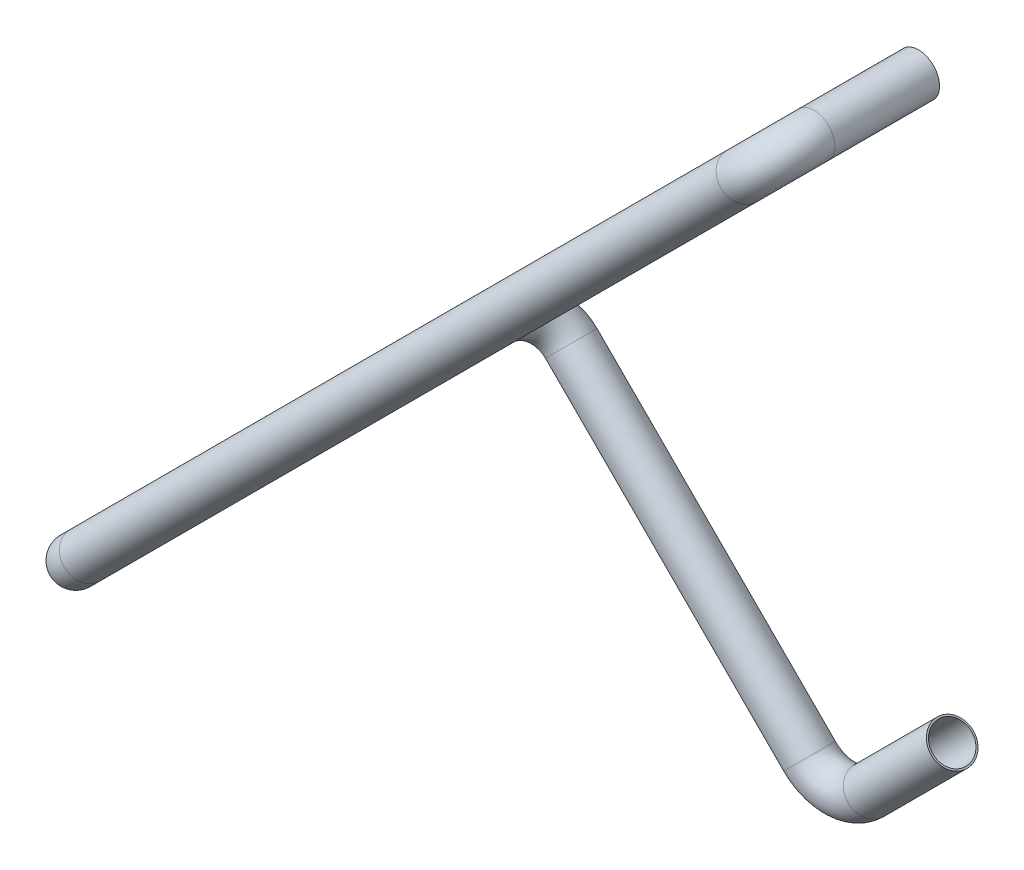
ISO-10303-21;
HEADER;
FILE_DESCRIPTION(('STEP AP214'),'2;1');
FILE_NAME('part.step','',(''),(''),'','','');
FILE_SCHEMA(('AUTOMOTIVE_DESIGN { 1 0 10303 214 1 1 1 1 }'));
ENDSEC;
DATA;
#1=APPLICATION_CONTEXT('core data for automotive mechanical design processes');
#2=APPLICATION_PROTOCOL_DEFINITION('international standard','automotive_design',2000,#1);
#3=PRODUCT_CONTEXT('',#1,'mechanical');
#4=PRODUCT('Part','Part','',(#3));
#5=PRODUCT_RELATED_PRODUCT_CATEGORY('part','',(#4));
#6=PRODUCT_DEFINITION_FORMATION('','',#4);
#7=PRODUCT_DEFINITION_CONTEXT('part definition',#1,'design');
#8=PRODUCT_DEFINITION('design','',#6,#7);
#9=PRODUCT_DEFINITION_SHAPE('','',#8);
#10=(LENGTH_UNIT() NAMED_UNIT(*) SI_UNIT(.MILLI.,.METRE.));
#11=(NAMED_UNIT(*) PLANE_ANGLE_UNIT() SI_UNIT($,.RADIAN.));
#12=(NAMED_UNIT(*) SI_UNIT($,.STERADIAN.) SOLID_ANGLE_UNIT());
#13=UNCERTAINTY_MEASURE_WITH_UNIT(LENGTH_MEASURE(1.E-05),#10,'distance_accuracy_value','');
#14=(GEOMETRIC_REPRESENTATION_CONTEXT(3) GLOBAL_UNCERTAINTY_ASSIGNED_CONTEXT((#13)) GLOBAL_UNIT_ASSIGNED_CONTEXT((#10,
#11,#12)) REPRESENTATION_CONTEXT('',''));
#15=CARTESIAN_POINT('',(0.,0.,0.));
#16=DIRECTION('',(0.,0.,1.));
#17=DIRECTION('',(1.,0.,0.));
#18=AXIS2_PLACEMENT_3D('',#15,#16,#17);
#19=CARTESIAN_POINT('',(-117.102539818742,-296.707662240125,-102.229900000001));
#20=DIRECTION('',(0.707106781186547,0.707106781186548,0.));
#21=DIRECTION('',(-0.707106781186548,0.707106781186547,0.));
#22=AXIS2_PLACEMENT_3D('',#19,#20,#21);
#23=CYLINDRICAL_SURFACE('',#22,6.35);
#24=CARTESIAN_POINT('',(-117.102539818742,-296.707662240125,-102.229900000001));
#25=DIRECTION('',(0.707106781186548,0.707106781186547,0.));
#26=DIRECTION('',(0.499999999999995,-0.500000000000006,0.707106781186548));
#27=AXIS2_PLACEMENT_3D('',#24,#25,#26);
#28=CIRCLE('',#27,6.35);
#29=CARTESIAN_POINT('',(-112.612411758207,-301.197790300659,-102.229900000001));
#30=VERTEX_POINT('',#29);
#31=EDGE_CURVE('E52',#30,#30,#28,.T.);
#32=ORIENTED_EDGE('',*,*,#31,.T.);
#33=EDGE_LOOP('',(#32));
#34=FACE_BOUND('',#33,.T.);
#35=CARTESIAN_POINT('',(-92.0709597647378,-271.676082186121,-102.229900000001));
#36=DIRECTION('',(0.707106781186548,0.707106781186547,0.));
#37=DIRECTION('',(0.499999999999995,-0.500000000000006,0.707106781186548));
#38=AXIS2_PLACEMENT_3D('',#35,#36,#37);
#39=CIRCLE('',#38,6.35);
#40=CARTESIAN_POINT('',(-88.8959597647378,-274.851082186121,-97.7397719394663));
#41=VERTEX_POINT('',#40);
#42=EDGE_CURVE('E12',#41,#41,#39,.T.);
#43=ORIENTED_EDGE('',*,*,#42,.F.);
#44=EDGE_LOOP('',(#43));
#45=FACE_BOUND('',#44,.T.);
#46=ADVANCED_FACE('F46',(#34,#45),#23,.T.);
#47=CARTESIAN_POINT('',(-126.082795939811,-287.727406119056,-102.229900000001));
#48=DIRECTION('',(0.,0.,1.));
#49=DIRECTION('',(0.,-1.,0.));
#50=AXIS2_PLACEMENT_3D('',#47,#48,#49);
#51=TOROIDAL_SURFACE('',#50,12.7,6.35);
#52=CARTESIAN_POINT('',(-135.06305206088,-296.707662240125,-102.229900000001));
#53=DIRECTION('',(0.707106781186548,-0.707106781186547,0.));
#54=DIRECTION('',(-0.500000000000004,-0.5,0.707106781186546));
#55=AXIS2_PLACEMENT_3D('',#52,#53,#54);
#56=CIRCLE('',#55,6.35);
#57=CARTESIAN_POINT('',(-139.553180121414,-301.197790300659,-102.229900000001));
#58=VERTEX_POINT('',#57);
#59=EDGE_CURVE('E56',#58,#58,#56,.T.);
#60=CARTESIAN_POINT('',(-126.082795939811,-287.727406119056,-102.229900000001));
#61=DIRECTION('',(0.,0.,1.));
#62=DIRECTION('',(0.,-1.,0.));
#63=AXIS2_PLACEMENT_3D('',#60,#61,#62);
#64=CIRCLE('',#63,19.05);
#65=EDGE_CURVE('',#58,#30,#64,.T.);
#66=ORIENTED_EDGE('',*,*,#59,.T.);
#67=ORIENTED_EDGE('',*,*,#31,.F.);
#68=ORIENTED_EDGE('',*,*,#65,.T.);
#69=ORIENTED_EDGE('',*,*,#65,.F.);
#70=EDGE_LOOP('',(#66,#68,#67,#69));
#71=FACE_BOUND('',#70,.T.);
#72=ADVANCED_FACE('F138',(#71),#51,.T.);
#73=CARTESIAN_POINT('',(-206.905101029433,-224.865613271571,-102.229900000001));
#74=DIRECTION('',(0.707106781186547,-0.707106781186548,0.));
#75=DIRECTION('',(0.707106781186548,0.707106781186547,0.));
#76=AXIS2_PLACEMENT_3D('',#73,#74,#75);
#77=CYLINDRICAL_SURFACE('',#76,6.35);
#78=CARTESIAN_POINT('',(-206.905101029433,-224.865613271571,-102.229900000001));
#79=DIRECTION('',(0.707106781186548,-0.707106781186547,0.));
#80=DIRECTION('',(-0.500000000000004,-0.5,0.707106781186546));
#81=AXIS2_PLACEMENT_3D('',#78,#79,#80);
#82=CIRCLE('',#81,6.35);
#83=CARTESIAN_POINT('',(-206.905101029433,-224.865613271571,-108.579900000001));
#84=VERTEX_POINT('',#83);
#85=EDGE_CURVE('E60',#84,#84,#82,.T.);
#86=ORIENTED_EDGE('',*,*,#85,.T.);
#87=EDGE_LOOP('',(#86));
#88=FACE_BOUND('',#87,.T.);
#89=ORIENTED_EDGE('',*,*,#59,.F.);
#90=EDGE_LOOP('',(#89));
#91=FACE_BOUND('',#90,.T.);
#92=ADVANCED_FACE('F142',(#88,#91),#77,.T.);
#93=CARTESIAN_POINT('',(-206.905101029433,-224.865613271571,-89.5299000000011));
#94=DIRECTION('',(-0.707106781186548,-0.707106781186548,0.));
#95=DIRECTION('',(0.707106781186548,-0.707106781186548,0.));
#96=AXIS2_PLACEMENT_3D('',#93,#94,#95);
#97=TOROIDAL_SURFACE('',#96,12.7,6.35);
#98=CARTESIAN_POINT('',(-215.885357150502,-215.885357150502,-89.529900000001));
#99=DIRECTION('',(0.,0.,-1.));
#100=DIRECTION('',(0.,-1.,0.));
#101=AXIS2_PLACEMENT_3D('',#98,#99,#100);
#102=CIRCLE('',#101,6.35);
#103=CARTESIAN_POINT('',(-220.375485211037,-211.395229089968,-89.5299000000009));
#104=VERTEX_POINT('',#103);
#105=EDGE_CURVE('E65',#104,#104,#102,.T.);
#106=CARTESIAN_POINT('',(-206.905101029433,-224.865613271571,-89.5299000000011));
#107=DIRECTION('',(-0.707106781186548,-0.707106781186548,0.));
#108=DIRECTION('',(0.707106781186548,-0.707106781186548,0.));
#109=AXIS2_PLACEMENT_3D('',#106,#107,#108);
#110=CIRCLE('',#109,19.05);
#111=EDGE_CURVE('',#104,#84,#110,.T.);
#112=ORIENTED_EDGE('',*,*,#105,.T.);
#113=ORIENTED_EDGE('',*,*,#85,.F.);
#114=ORIENTED_EDGE('',*,*,#111,.T.);
#115=ORIENTED_EDGE('',*,*,#111,.F.);
#116=EDGE_LOOP('',(#112,#114,#113,#115));
#117=FACE_BOUND('',#116,.T.);
#118=ADVANCED_FACE('F148',(#117),#97,.T.);
#119=CARTESIAN_POINT('',(-215.885357150503,-215.885357150503,31.5419456141631));
#120=DIRECTION('',(0.,0.,-1.));
#121=DIRECTION('',(-1.,0.,0.));
#122=AXIS2_PLACEMENT_3D('',#119,#120,#121);
#123=CYLINDRICAL_SURFACE('',#122,6.35);
#124=CARTESIAN_POINT('',(-215.885357150503,-215.885357150503,31.5419456141631));
#125=DIRECTION('',(0.,0.,-1.));
#126=DIRECTION('',(0.,-1.,0.));
#127=AXIS2_PLACEMENT_3D('',#124,#125,#126);
#128=CIRCLE('',#127,6.35);
#129=CARTESIAN_POINT('',(-220.375485211037,-220.375485211037,31.5419456141631));
#130=VERTEX_POINT('',#129);
#131=EDGE_CURVE('E68',#130,#130,#128,.T.);
#132=ORIENTED_EDGE('',*,*,#131,.T.);
#133=EDGE_LOOP('',(#132));
#134=FACE_BOUND('',#133,.T.);
#135=ORIENTED_EDGE('',*,*,#105,.F.);
#136=EDGE_LOOP('',(#135));
#137=FACE_BOUND('',#136,.T.);
#138=ADVANCED_FACE('F155',(#134,#137),#123,.T.);
#139=CARTESIAN_POINT('',(-206.905101029433,-206.905101029433,31.5419456141631));
#140=DIRECTION('',(0.707106781186548,-0.707106781186548,0.));
#141=DIRECTION('',(0.707106781186548,0.707106781186548,0.));
#142=AXIS2_PLACEMENT_3D('',#139,#140,#141);
#143=TOROIDAL_SURFACE('',#142,12.7,6.35);
#144=CARTESIAN_POINT('',(-206.905101029433,-206.905101029433,44.2419456141631));
#145=DIRECTION('',(-0.707106781186548,-0.707106781186548,0.));
#146=DIRECTION('',(0.499999999999999,-0.500000000000001,0.707106781186548));
#147=AXIS2_PLACEMENT_3D('',#144,#145,#146);
#148=CIRCLE('',#147,6.35);
#149=CARTESIAN_POINT('',(-206.905101029433,-206.905101029433,50.5919456141631));
#150=VERTEX_POINT('',#149);
#151=EDGE_CURVE('E71',#150,#150,#148,.T.);
#152=CARTESIAN_POINT('',(-206.905101029433,-206.905101029433,31.5419456141631));
#153=DIRECTION('',(0.707106781186548,-0.707106781186548,0.));
#154=DIRECTION('',(0.707106781186548,0.707106781186548,0.));
#155=AXIS2_PLACEMENT_3D('',#152,#153,#154);
#156=CIRCLE('',#155,19.05);
#157=EDGE_CURVE('',#150,#130,#156,.T.);
#158=ORIENTED_EDGE('',*,*,#151,.T.);
#159=ORIENTED_EDGE('',*,*,#131,.F.);
#160=ORIENTED_EDGE('',*,*,#157,.T.);
#161=ORIENTED_EDGE('',*,*,#157,.F.);
#162=EDGE_LOOP('',(#158,#160,#159,#161));
#163=FACE_BOUND('',#162,.T.);
#164=ADVANCED_FACE('F159',(#163),#143,.T.);
#165=CARTESIAN_POINT('',(-8.98025612106917,-8.98025612106917,44.2419456141641));
#166=DIRECTION('',(-0.707106781186547,-0.707106781186547,0.));
#167=DIRECTION('',(0.707106781186548,-0.707106781186548,0.));
#168=AXIS2_PLACEMENT_3D('',#165,#166,#167);
#169=CYLINDRICAL_SURFACE('',#168,6.35);
#170=CARTESIAN_POINT('',(-8.98025612106917,-8.98025612106917,44.2419456141641));
#171=DIRECTION('',(-0.707106781186548,-0.707106781186548,0.));
#172=DIRECTION('',(0.499999999999999,-0.500000000000001,0.707106781186548));
#173=AXIS2_PLACEMENT_3D('',#170,#171,#172);
#174=CIRCLE('',#173,6.35);
#175=CARTESIAN_POINT('',(-8.98025612106918,-8.98025612106918,50.5919456141641));
#176=VERTEX_POINT('',#175);
#177=EDGE_CURVE('E74',#176,#176,#174,.T.);
#178=ORIENTED_EDGE('',*,*,#177,.T.);
#179=EDGE_LOOP('',(#178));
#180=FACE_BOUND('',#179,.T.);
#181=ORIENTED_EDGE('',*,*,#151,.F.);
#182=EDGE_LOOP('',(#181));
#183=FACE_BOUND('',#182,.T.);
#184=ADVANCED_FACE('F163',(#180,#183),#169,.T.);
#185=CARTESIAN_POINT('',(-8.98025612106916,-8.98025612106916,31.5419456141641));
#186=DIRECTION('',(0.707106781186548,-0.707106781186548,0.));
#187=DIRECTION('',(0.707106781186548,0.707106781186548,0.));
#188=AXIS2_PLACEMENT_3D('',#185,#186,#187);
#189=TOROIDAL_SURFACE('',#188,12.7,6.35);
#190=CARTESIAN_POINT('',(0.,0.,31.5419456141641));
#191=DIRECTION('',(0.,0.,1.));
#192=DIRECTION('',(1.,0.,0.));
#193=AXIS2_PLACEMENT_3D('',#190,#191,#192);
#194=CIRCLE('',#193,6.35);
#195=CARTESIAN_POINT('',(4.49012806053458,4.49012806053458,31.5419456141641));
#196=VERTEX_POINT('',#195);
#197=EDGE_CURVE('E77',#196,#196,#194,.T.);
#198=CARTESIAN_POINT('',(-8.98025612106916,-8.98025612106916,31.5419456141641));
#199=DIRECTION('',(0.707106781186548,-0.707106781186548,0.));
#200=DIRECTION('',(0.707106781186548,0.707106781186548,0.));
#201=AXIS2_PLACEMENT_3D('',#198,#199,#200);
#202=CIRCLE('',#201,19.05);
#203=EDGE_CURVE('',#196,#176,#202,.T.);
#204=ORIENTED_EDGE('',*,*,#197,.T.);
#205=ORIENTED_EDGE('',*,*,#177,.F.);
#206=ORIENTED_EDGE('',*,*,#203,.T.);
#207=ORIENTED_EDGE('',*,*,#203,.F.);
#208=EDGE_LOOP('',(#204,#206,#205,#207));
#209=FACE_BOUND('',#208,.T.);
#210=ADVANCED_FACE('F133',(#209),#189,.T.);
#211=CARTESIAN_POINT('',(0.,0.,31.5419456141641));
#212=DIRECTION('',(0.,0.,-1.));
#213=DIRECTION('',(-1.,0.,0.));
#214=AXIS2_PLACEMENT_3D('',#211,#212,#213);
#215=CYLINDRICAL_SURFACE('',#214,6.35);
#216=ORIENTED_EDGE('',*,*,#197,.F.);
#217=EDGE_LOOP('',(#216));
#218=FACE_BOUND('',#217,.T.);
#219=CARTESIAN_POINT('',(0.,0.,0.));
#220=DIRECTION('',(0.,0.,1.));
#221=DIRECTION('',(1.,0.,0.));
#222=AXIS2_PLACEMENT_3D('',#219,#220,#221);
#223=CIRCLE('',#222,6.35);
#224=CARTESIAN_POINT('',(6.35,0.,0.));
#225=VERTEX_POINT('',#224);
#226=EDGE_CURVE('E78',#225,#225,#223,.T.);
#227=ORIENTED_EDGE('',*,*,#226,.T.);
#228=EDGE_LOOP('',(#227));
#229=FACE_BOUND('',#228,.T.);
#230=ADVANCED_FACE('F125',(#218,#229),#215,.T.);
#231=CARTESIAN_POINT('',(-92.0709597647378,-271.676082186121,-102.229900000001));
#232=DIRECTION('',(0.707106781186548,0.707106781186547,0.));
#233=DIRECTION('',(0.499999999999995,-0.500000000000006,0.707106781186548));
#234=AXIS2_PLACEMENT_3D('',#231,#232,#233);
#235=PLANE('',#234);
#236=CARTESIAN_POINT('',(-92.0709597647378,-271.676082186121,-102.229900000001));
#237=DIRECTION('',(0.707106781186548,0.707106781186547,0.));
#238=DIRECTION('',(-0.707106781186547,0.707106781186548,0.));
#239=AXIS2_PLACEMENT_3D('',#236,#237,#238);
#240=CIRCLE('',#239,5.842);
#241=CARTESIAN_POINT('',(-96.2018775804296,-267.545164370429,-102.229900000001));
#242=VERTEX_POINT('',#241);
#243=EDGE_CURVE('E81',#242,#242,#240,.T.);
#244=ORIENTED_EDGE('',*,*,#243,.F.);
#245=EDGE_LOOP('',(#244));
#246=FACE_BOUND('',#245,.T.);
#247=ORIENTED_EDGE('',*,*,#42,.T.);
#248=EDGE_LOOP('',(#247));
#249=FACE_BOUND('',#248,.T.);
#250=ADVANCED_FACE('F123',(#246,#249),#235,.T.);
#251=CARTESIAN_POINT('',(0.,0.,0.));
#252=DIRECTION('',(0.,0.,1.));
#253=DIRECTION('',(1.,0.,0.));
#254=AXIS2_PLACEMENT_3D('',#251,#252,#253);
#255=PLANE('',#254);
#256=CARTESIAN_POINT('',(0.,0.,0.));
#257=DIRECTION('',(0.,0.,1.));
#258=DIRECTION('',(1.,0.,0.));
#259=AXIS2_PLACEMENT_3D('',#256,#257,#258);
#260=CIRCLE('',#259,5.842);
#261=CARTESIAN_POINT('',(5.842,0.,0.));
#262=VERTEX_POINT('',#261);
#263=EDGE_CURVE('E84',#262,#262,#260,.T.);
#264=ORIENTED_EDGE('',*,*,#263,.T.);
#265=EDGE_LOOP('',(#264));
#266=FACE_BOUND('',#265,.T.);
#267=ORIENTED_EDGE('',*,*,#226,.F.);
#268=EDGE_LOOP('',(#267));
#269=FACE_BOUND('',#268,.T.);
#270=ADVANCED_FACE('F119',(#266,#269),#255,.F.);
#271=CARTESIAN_POINT('',(-117.102539818742,-296.707662240125,-102.229900000001));
#272=DIRECTION('',(0.707106781186547,0.707106781186548,0.));
#273=DIRECTION('',(-0.707106781186548,0.707106781186547,0.));
#274=AXIS2_PLACEMENT_3D('',#271,#272,#273);
#275=CYLINDRICAL_SURFACE('',#274,5.842);
#276=CARTESIAN_POINT('',(-117.102539818742,-296.707662240125,-102.229900000001));
#277=DIRECTION('',(0.707106781186547,0.707106781186548,0.));
#278=DIRECTION('',(-0.707106781186548,0.707106781186547,0.));
#279=AXIS2_PLACEMENT_3D('',#276,#277,#278);
#280=CIRCLE('',#279,5.842);
#281=CARTESIAN_POINT('',(-112.97162200305,-300.838580055817,-102.229900000001));
#282=VERTEX_POINT('',#281);
#283=EDGE_CURVE('E90',#282,#282,#280,.T.);
#284=ORIENTED_EDGE('',*,*,#283,.F.);
#285=EDGE_LOOP('',(#284));
#286=FACE_BOUND('',#285,.T.);
#287=ORIENTED_EDGE('',*,*,#243,.T.);
#288=EDGE_LOOP('',(#287));
#289=FACE_BOUND('',#288,.T.);
#290=ADVANCED_FACE('F116',(#286,#289),#275,.F.);
#291=CARTESIAN_POINT('',(-126.082795939811,-287.727406119056,-102.229900000001));
#292=DIRECTION('',(0.,0.,1.));
#293=DIRECTION('',(0.,-1.,0.));
#294=AXIS2_PLACEMENT_3D('',#291,#292,#293);
#295=TOROIDAL_SURFACE('',#294,12.7,5.842);
#296=CARTESIAN_POINT('',(-135.06305206088,-296.707662240125,-102.229900000001));
#297=DIRECTION('',(-0.70710678118655,0.707106781186545,0.));
#298=DIRECTION('',(-0.707106781186545,-0.70710678118655,0.));
#299=AXIS2_PLACEMENT_3D('',#296,#297,#298);
#300=CIRCLE('',#299,5.842);
#301=CARTESIAN_POINT('',(-139.193969876572,-300.838580055817,-102.229900000001));
#302=VERTEX_POINT('',#301);
#303=EDGE_CURVE('E108',#302,#302,#300,.F.);
#304=CARTESIAN_POINT('',(-126.082795939811,-287.727406119056,-102.229900000001));
#305=DIRECTION('',(0.,0.,1.));
#306=DIRECTION('',(0.,-1.,0.));
#307=AXIS2_PLACEMENT_3D('',#304,#305,#306);
#308=CIRCLE('',#307,18.542);
#309=EDGE_CURVE('',#302,#282,#308,.T.);
#310=ORIENTED_EDGE('',*,*,#303,.F.);
#311=ORIENTED_EDGE('',*,*,#283,.T.);
#312=ORIENTED_EDGE('',*,*,#309,.T.);
#313=ORIENTED_EDGE('',*,*,#309,.F.);
#314=EDGE_LOOP('',(#310,#312,#311,#313));
#315=FACE_BOUND('',#314,.T.);
#316=ADVANCED_FACE('F114',(#315),#295,.F.);
#317=CARTESIAN_POINT('',(-206.905101029433,-224.865613271571,-102.229900000001));
#318=DIRECTION('',(0.707106781186547,-0.707106781186548,0.));
#319=DIRECTION('',(0.707106781186548,0.707106781186547,0.));
#320=AXIS2_PLACEMENT_3D('',#317,#318,#319);
#321=CYLINDRICAL_SURFACE('',#320,5.842);
#322=CARTESIAN_POINT('',(-206.905101029433,-224.865613271571,-102.229900000001));
#323=DIRECTION('',(0.707106781186547,-0.707106781186548,0.));
#324=DIRECTION('',(0.707106781186548,0.707106781186547,0.));
#325=AXIS2_PLACEMENT_3D('',#322,#323,#324);
#326=CIRCLE('',#325,5.842);
#327=CARTESIAN_POINT('',(-206.905101029433,-224.865613271571,-108.071900000001));
#328=VERTEX_POINT('',#327);
#329=EDGE_CURVE('E105',#328,#328,#326,.T.);
#330=ORIENTED_EDGE('',*,*,#329,.F.);
#331=EDGE_LOOP('',(#330));
#332=FACE_BOUND('',#331,.T.);
#333=ORIENTED_EDGE('',*,*,#303,.T.);
#334=EDGE_LOOP('',(#333));
#335=FACE_BOUND('',#334,.T.);
#336=ADVANCED_FACE('F219',(#332,#335),#321,.F.);
#337=CARTESIAN_POINT('',(-206.905101029433,-224.865613271571,-89.5299000000011));
#338=DIRECTION('',(-0.707106781186548,-0.707106781186548,0.));
#339=DIRECTION('',(0.707106781186548,-0.707106781186548,0.));
#340=AXIS2_PLACEMENT_3D('',#337,#338,#339);
#341=TOROIDAL_SURFACE('',#340,12.7,5.842);
#342=CARTESIAN_POINT('',(-215.885357150502,-215.885357150502,-89.529900000001));
#343=DIRECTION('',(0.,0.,1.));
#344=DIRECTION('',(0.,-1.,0.));
#345=AXIS2_PLACEMENT_3D('',#342,#343,#344);
#346=CIRCLE('',#345,5.842);
#347=CARTESIAN_POINT('',(-220.016274966194,-211.75443933481,-89.529900000001));
#348=VERTEX_POINT('',#347);
#349=EDGE_CURVE('E102',#348,#348,#346,.F.);
#350=CARTESIAN_POINT('',(-206.905101029433,-224.865613271571,-89.5299000000011));
#351=DIRECTION('',(-0.707106781186548,-0.707106781186548,0.));
#352=DIRECTION('',(0.707106781186548,-0.707106781186548,0.));
#353=AXIS2_PLACEMENT_3D('',#350,#351,#352);
#354=CIRCLE('',#353,18.542);
#355=EDGE_CURVE('',#348,#328,#354,.T.);
#356=ORIENTED_EDGE('',*,*,#349,.F.);
#357=ORIENTED_EDGE('',*,*,#329,.T.);
#358=ORIENTED_EDGE('',*,*,#355,.T.);
#359=ORIENTED_EDGE('',*,*,#355,.F.);
#360=EDGE_LOOP('',(#356,#358,#357,#359));
#361=FACE_BOUND('',#360,.T.);
#362=ADVANCED_FACE('F229',(#361),#341,.F.);
#363=CARTESIAN_POINT('',(-215.885357150503,-215.885357150503,31.5419456141631));
#364=DIRECTION('',(0.,0.,-1.));
#365=DIRECTION('',(-1.,0.,0.));
#366=AXIS2_PLACEMENT_3D('',#363,#364,#365);
#367=CYLINDRICAL_SURFACE('',#366,5.842);
#368=CARTESIAN_POINT('',(-215.885357150503,-215.885357150503,31.5419456141631));
#369=DIRECTION('',(0.,0.,-1.));
#370=DIRECTION('',(-1.,0.,0.));
#371=AXIS2_PLACEMENT_3D('',#368,#369,#370);
#372=CIRCLE('',#371,5.842);
#373=CARTESIAN_POINT('',(-220.016274966194,-220.016274966194,31.5419456141631));
#374=VERTEX_POINT('',#373);
#375=EDGE_CURVE('E99',#374,#374,#372,.T.);
#376=ORIENTED_EDGE('',*,*,#375,.F.);
#377=EDGE_LOOP('',(#376));
#378=FACE_BOUND('',#377,.T.);
#379=ORIENTED_EDGE('',*,*,#349,.T.);
#380=EDGE_LOOP('',(#379));
#381=FACE_BOUND('',#380,.T.);
#382=ADVANCED_FACE('F239',(#378,#381),#367,.F.);
#383=CARTESIAN_POINT('',(-206.905101029433,-206.905101029433,31.5419456141631));
#384=DIRECTION('',(0.707106781186548,-0.707106781186548,0.));
#385=DIRECTION('',(0.707106781186548,0.707106781186548,0.));
#386=AXIS2_PLACEMENT_3D('',#383,#384,#385);
#387=TOROIDAL_SURFACE('',#386,12.7,5.842);
#388=CARTESIAN_POINT('',(-206.905101029433,-206.905101029433,44.2419456141631));
#389=DIRECTION('',(0.707106781186548,0.707106781186548,0.));
#390=DIRECTION('',(-0.707106781186548,0.707106781186548,0.));
#391=AXIS2_PLACEMENT_3D('',#388,#389,#390);
#392=CIRCLE('',#391,5.842);
#393=CARTESIAN_POINT('',(-206.905101029433,-206.905101029433,50.0839456141631));
#394=VERTEX_POINT('',#393);
#395=EDGE_CURVE('E96',#394,#394,#392,.F.);
#396=CARTESIAN_POINT('',(-206.905101029433,-206.905101029433,31.5419456141631));
#397=DIRECTION('',(0.707106781186548,-0.707106781186548,0.));
#398=DIRECTION('',(0.707106781186548,0.707106781186548,0.));
#399=AXIS2_PLACEMENT_3D('',#396,#397,#398);
#400=CIRCLE('',#399,18.542);
#401=EDGE_CURVE('',#394,#374,#400,.T.);
#402=ORIENTED_EDGE('',*,*,#395,.F.);
#403=ORIENTED_EDGE('',*,*,#375,.T.);
#404=ORIENTED_EDGE('',*,*,#401,.T.);
#405=ORIENTED_EDGE('',*,*,#401,.F.);
#406=EDGE_LOOP('',(#402,#404,#403,#405));
#407=FACE_BOUND('',#406,.T.);
#408=ADVANCED_FACE('F249',(#407),#387,.F.);
#409=CARTESIAN_POINT('',(-8.98025612106917,-8.98025612106917,44.2419456141641));
#410=DIRECTION('',(-0.707106781186547,-0.707106781186547,0.));
#411=DIRECTION('',(0.707106781186548,-0.707106781186548,0.));
#412=AXIS2_PLACEMENT_3D('',#409,#410,#411);
#413=CYLINDRICAL_SURFACE('',#412,5.842);
#414=CARTESIAN_POINT('',(-8.98025612106917,-8.98025612106917,44.2419456141641));
#415=DIRECTION('',(-0.707106781186547,-0.707106781186547,0.));
#416=DIRECTION('',(0.707106781186548,-0.707106781186548,0.));
#417=AXIS2_PLACEMENT_3D('',#414,#415,#416);
#418=CIRCLE('',#417,5.842);
#419=CARTESIAN_POINT('',(-8.98025612106917,-8.98025612106917,50.0839456141641));
#420=VERTEX_POINT('',#419);
#421=EDGE_CURVE('E93',#420,#420,#418,.T.);
#422=ORIENTED_EDGE('',*,*,#421,.F.);
#423=EDGE_LOOP('',(#422));
#424=FACE_BOUND('',#423,.T.);
#425=ORIENTED_EDGE('',*,*,#395,.T.);
#426=EDGE_LOOP('',(#425));
#427=FACE_BOUND('',#426,.T.);
#428=ADVANCED_FACE('F259',(#424,#427),#413,.F.);
#429=CARTESIAN_POINT('',(-8.98025612106916,-8.98025612106916,31.5419456141641));
#430=DIRECTION('',(0.707106781186548,-0.707106781186548,0.));
#431=DIRECTION('',(0.707106781186548,0.707106781186548,0.));
#432=AXIS2_PLACEMENT_3D('',#429,#430,#431);
#433=TOROIDAL_SURFACE('',#432,12.7,5.842);
#434=CARTESIAN_POINT('',(0.,0.,31.5419456141641));
#435=DIRECTION('',(0.,0.,-1.));
#436=DIRECTION('',(-1.,0.,0.));
#437=AXIS2_PLACEMENT_3D('',#434,#435,#436);
#438=CIRCLE('',#437,5.842);
#439=CARTESIAN_POINT('',(4.13091781569181,4.13091781569181,31.5419456141641));
#440=VERTEX_POINT('',#439);
#441=EDGE_CURVE('E87',#440,#440,#438,.F.);
#442=CARTESIAN_POINT('',(-8.98025612106916,-8.98025612106916,31.5419456141641));
#443=DIRECTION('',(0.707106781186548,-0.707106781186548,0.));
#444=DIRECTION('',(0.707106781186548,0.707106781186548,0.));
#445=AXIS2_PLACEMENT_3D('',#442,#443,#444);
#446=CIRCLE('',#445,18.542);
#447=EDGE_CURVE('',#440,#420,#446,.T.);
#448=ORIENTED_EDGE('',*,*,#441,.F.);
#449=ORIENTED_EDGE('',*,*,#421,.T.);
#450=ORIENTED_EDGE('',*,*,#447,.T.);
#451=ORIENTED_EDGE('',*,*,#447,.F.);
#452=EDGE_LOOP('',(#448,#450,#449,#451));
#453=FACE_BOUND('',#452,.T.);
#454=ADVANCED_FACE('F269',(#453),#433,.F.);
#455=CARTESIAN_POINT('',(0.,0.,31.5419456141641));
#456=DIRECTION('',(0.,0.,-1.));
#457=DIRECTION('',(-1.,0.,0.));
#458=AXIS2_PLACEMENT_3D('',#455,#456,#457);
#459=CYLINDRICAL_SURFACE('',#458,5.842);
#460=ORIENTED_EDGE('',*,*,#441,.T.);
#461=EDGE_LOOP('',(#460));
#462=FACE_BOUND('',#461,.T.);
#463=ORIENTED_EDGE('',*,*,#263,.F.);
#464=EDGE_LOOP('',(#463));
#465=FACE_BOUND('',#464,.T.);
#466=ADVANCED_FACE('F279',(#462,#465),#459,.F.);
#467=CLOSED_SHELL('',(#46,#72,#92,#118,#138,#164,#184,#210,#230,#250,#270,#290,#316,#336,#362,
#382,#408,#428,#454,#466));
#468=MANIFOLD_SOLID_BREP('B2',#467);
#469=ADVANCED_BREP_SHAPE_REPRESENTATION('',(#18,#468),#14);
#470=SHAPE_DEFINITION_REPRESENTATION(#9,#469);
ENDSEC;
END-ISO-10303-21;
